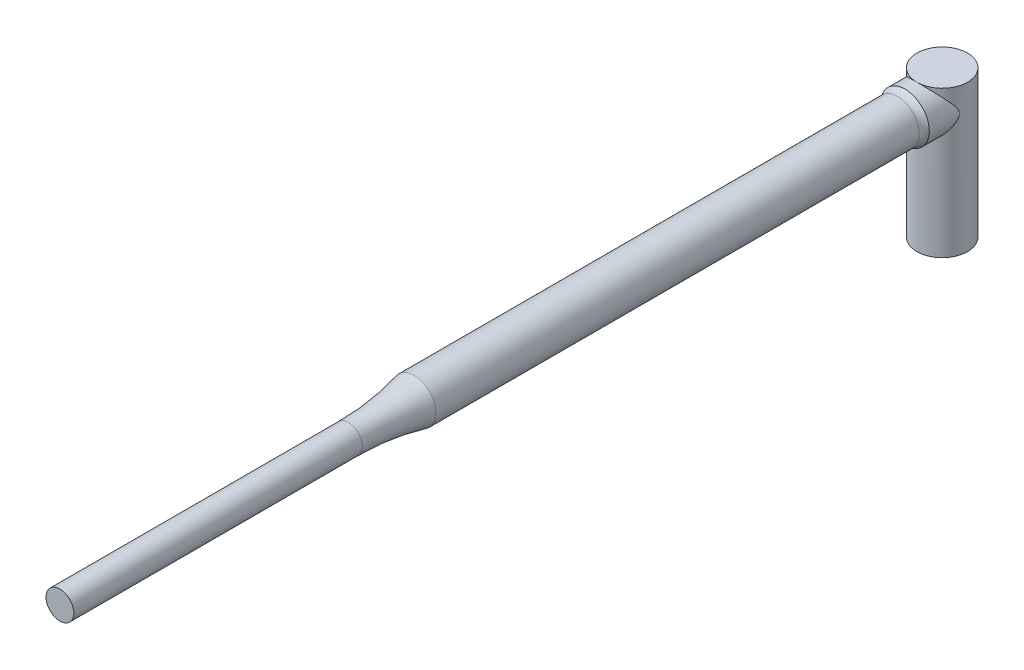
ISO-10303-21;
HEADER;
FILE_DESCRIPTION(('STEP AP214'),'2;1');
FILE_NAME('part.step','',(''),(''),'','','');
FILE_SCHEMA(('AUTOMOTIVE_DESIGN { 1 0 10303 214 1 1 1 1 }'));
ENDSEC;
DATA;
#1=APPLICATION_CONTEXT('core data for automotive mechanical design processes');
#2=APPLICATION_PROTOCOL_DEFINITION('international standard','automotive_design',2000,#1);
#3=PRODUCT_CONTEXT('',#1,'mechanical');
#4=PRODUCT('Part','Part','',(#3));
#5=PRODUCT_RELATED_PRODUCT_CATEGORY('part','',(#4));
#6=PRODUCT_DEFINITION_FORMATION('','',#4);
#7=PRODUCT_DEFINITION_CONTEXT('part definition',#1,'design');
#8=PRODUCT_DEFINITION('design','',#6,#7);
#9=PRODUCT_DEFINITION_SHAPE('','',#8);
#10=(LENGTH_UNIT() NAMED_UNIT(*) SI_UNIT(.MILLI.,.METRE.));
#11=(NAMED_UNIT(*) PLANE_ANGLE_UNIT() SI_UNIT($,.RADIAN.));
#12=(NAMED_UNIT(*) SI_UNIT($,.STERADIAN.) SOLID_ANGLE_UNIT());
#13=UNCERTAINTY_MEASURE_WITH_UNIT(LENGTH_MEASURE(1.E-05),#10,'distance_accuracy_value','');
#14=(GEOMETRIC_REPRESENTATION_CONTEXT(3) GLOBAL_UNCERTAINTY_ASSIGNED_CONTEXT((#13)) GLOBAL_UNIT_ASSIGNED_CONTEXT((#10,
#11,#12)) REPRESENTATION_CONTEXT('',''));
#15=CARTESIAN_POINT('',(0.,0.,0.));
#16=DIRECTION('',(0.,0.,1.));
#17=DIRECTION('',(1.,0.,0.));
#18=AXIS2_PLACEMENT_3D('',#15,#16,#17);
#19=CARTESIAN_POINT('',(0.,29.,0.));
#20=DIRECTION('',(0.,-1.,0.));
#21=DIRECTION('',(0.,0.,-1.));
#22=AXIS2_PLACEMENT_3D('',#19,#20,#21);
#23=CYLINDRICAL_SURFACE('',#22,5.);
#24=CARTESIAN_POINT('',(0.,0.,0.));
#25=DIRECTION('',(0.,1.,0.));
#26=DIRECTION('',(0.,0.,1.));
#27=AXIS2_PLACEMENT_3D('',#24,#25,#26);
#28=CIRCLE('',#27,5.);
#29=CARTESIAN_POINT('',(0.,0.,5.));
#30=VERTEX_POINT('',#29);
#31=EDGE_CURVE('E57',#30,#30,#28,.T.);
#32=ORIENTED_EDGE('',*,*,#31,.T.);
#33=EDGE_LOOP('',(#32));
#34=FACE_BOUND('',#33,.T.);
#35=CARTESIAN_POINT('',(0.,29.,0.));
#36=DIRECTION('',(0.,1.,0.));
#37=DIRECTION('',(0.,0.,1.));
#38=AXIS2_PLACEMENT_3D('',#35,#36,#37);
#39=CIRCLE('',#38,5.);
#40=CARTESIAN_POINT('',(0.,29.,5.));
#41=VERTEX_POINT('',#40);
#42=EDGE_CURVE('E52',#41,#41,#39,.T.);
#43=ORIENTED_EDGE('',*,*,#42,.F.);
#44=CARTESIAN_POINT('',(0.,29.,5.));
#45=CARTESIAN_POINT('',(-0.108666334102559,28.9999994876729,4.99999948894301));
#46=CARTESIAN_POINT('',(-0.217341014836858,28.9963027031347,4.99645026906441));
#47=CARTESIAN_POINT('',(-0.433779392075084,28.9815907093796,4.98232932673554));
#48=CARTESIAN_POINT('',(-0.541542617537456,28.9705719253294,4.97175417400158));
#49=CARTESIAN_POINT('',(-0.755368421051561,28.9414216519406,4.94379028020062));
#50=CARTESIAN_POINT('',(-0.861428193944477,28.9232794773518,4.92639130328448));
#51=CARTESIAN_POINT('',(-1.07092716138335,28.880230653768,4.88513267549212));
#52=CARTESIAN_POINT('',(-1.17436508698639,28.8553207951497,4.86126995915675));
#53=CARTESIAN_POINT('',(-1.37713940050348,28.7993982975048,4.80774371752179));
#54=CARTESIAN_POINT('',(-1.47650078238514,28.7684329596938,4.77812516341369));
#55=CARTESIAN_POINT('',(-1.6714539107134,28.7007666333182,4.71347013231617));
#56=CARTESIAN_POINT('',(-1.7670442353715,28.6640635068546,4.67843163590859));
#57=CARTESIAN_POINT('',(-2.04742973414759,28.5461584532109,4.56601914203934));
#58=CARTESIAN_POINT('',(-2.22603488476282,28.4571054817868,4.48129500256816));
#59=CARTESIAN_POINT('',(-2.63413344553697,28.22209656589,4.25855646492008));
#60=CARTESIAN_POINT('',(-2.85461963750567,28.0677546972577,4.11290956708302));
#61=CARTESIAN_POINT('',(-3.15758927850058,27.8175819801787,3.87892226792849));
#62=CARTESIAN_POINT('',(-3.25410546384993,27.7309030782729,3.79817625785519));
#63=CARTESIAN_POINT('',(-3.43805978110448,27.5520413742906,3.63249829685912));
#64=CARTESIAN_POINT('',(-3.52549848446378,27.4598589192552,3.54756660993398));
#65=CARTESIAN_POINT('',(-3.71912950135635,27.2391200290437,3.34568840161989));
#66=CARTESIAN_POINT('',(-3.82186969196473,27.1086737661815,3.22749960471579));
#67=CARTESIAN_POINT('',(-4.01217062153544,26.8400028696814,2.98762809792712));
#68=CARTESIAN_POINT('',(-4.0997209748483,26.701772999074,2.865943063326));
#69=CARTESIAN_POINT('',(-4.25993294561414,26.4179924993914,2.62187857925505));
#70=CARTESIAN_POINT('',(-4.33261742665085,26.2724535476714,2.4995004982114));
#71=CARTESIAN_POINT('',(-4.46351509384735,25.9730701537287,2.25739480813768));
#72=CARTESIAN_POINT('',(-4.52174353737661,25.8192346785317,2.13766452720062));
#73=CARTESIAN_POINT('',(-4.60716250829844,25.5516269909255,1.94457484411109));
#74=CARTESIAN_POINT('',(-4.63830721094698,25.4409290576665,1.86871083524089));
#75=CARTESIAN_POINT('',(-4.69349383270595,25.2123994217591,1.72538006713553));
#76=CARTESIAN_POINT('',(-4.71754210301083,25.0945742124323,1.65790583068008));
#77=CARTESIAN_POINT('',(-4.75132517833322,24.8872110971655,1.55782052198113));
#78=CARTESIAN_POINT('',(-4.76318681985278,24.80017193551,1.5208776230768));
#79=CARTESIAN_POINT('',(-4.78231414591119,24.6213032933281,1.45962757350143));
#80=CARTESIAN_POINT('',(-4.78959424608012,24.5294898321668,1.43528083299412));
#81=CARTESIAN_POINT('',(-4.79802441699647,24.3581775537683,1.40682571805981));
#82=CARTESIAN_POINT('',(-4.79999652004894,24.2791895025968,1.40001211684442));
#83=CARTESIAN_POINT('',(-4.80000346934737,24.121262193135,1.39998791962794));
#84=CARTESIAN_POINT('',(-4.7980407931867,24.0423229354284,1.4067687636784));
#85=CARTESIAN_POINT('',(-4.78932829003187,23.864891728207,1.43618059644902));
#86=CARTESIAN_POINT('',(-4.78138869455439,23.7671355925422,1.46272859601791));
#87=CARTESIAN_POINT('',(-4.76036043230233,23.5769172183916,1.52976591044666));
#88=CARTESIAN_POINT('',(-4.74724513847658,23.4844852344281,1.57032718183002));
#89=CARTESIAN_POINT('',(-4.71127096382163,23.2731042597668,1.67570655399337));
#90=CARTESIAN_POINT('',(-4.68660743768743,23.1562694614043,1.74403785776021));
#91=CARTESIAN_POINT('',(-4.6302315276597,22.9293166457595,1.88866250883097));
#92=CARTESIAN_POINT('',(-4.59850395114825,22.819213767308,1.96497282606616));
#93=CARTESIAN_POINT('',(-4.52819195095979,22.6036362455162,2.12200921039833));
#94=CARTESIAN_POINT('',(-4.48957489136809,22.4981867491046,2.20275496985636));
#95=CARTESIAN_POINT('',(-4.40571664792901,22.2915793992254,2.36602915853915));
#96=CARTESIAN_POINT('',(-4.36048113484795,22.1904179664512,2.44855601060833));
#97=CARTESIAN_POINT('',(-4.24145351730467,21.9470467280173,2.65130405002382));
#98=CARTESIAN_POINT('',(-4.16396833941558,21.8068388286845,2.77178442584361));
#99=CARTESIAN_POINT('',(-3.99451034792092,21.5335934537786,3.01088153042212));
#100=CARTESIAN_POINT('',(-3.90252854299023,21.4005604975536,3.12949705198216));
#101=CARTESIAN_POINT('',(-3.70395995163979,21.1427054944133,3.36213857773947));
#102=CARTESIAN_POINT('',(-3.59743011781207,21.0178541080341,3.47618033951546));
#103=CARTESIAN_POINT('',(-3.36907404148919,20.7770100257808,3.69792725597155));
#104=CARTESIAN_POINT('',(-3.24725829058651,20.6610113407852,3.80563668313373));
#105=CARTESIAN_POINT('',(-2.94897718188619,20.4062360164895,4.04351087483246));
#106=CARTESIAN_POINT('',(-2.7670579956831,20.2710087985499,4.17076979191824));
#107=CARTESIAN_POINT('',(-2.37658270610564,20.0232549286279,4.40494944861695));
#108=CARTESIAN_POINT('',(-2.16805556184616,19.9107039351284,4.51189198947898));
#109=CARTESIAN_POINT('',(-1.76375821447192,19.7312960343797,4.68280962418389));
#110=CARTESIAN_POINT('',(-1.57182598295789,19.6599263992792,4.75099628140664));
#111=CARTESIAN_POINT('',(-1.27378233111778,19.5709314083165,4.8361351842589));
#112=CARTESIAN_POINT('',(-1.17271762786842,19.5442720160726,4.86166211251646));
#113=CARTESIAN_POINT('',(-0.967782848202917,19.4974024003608,4.90656483655382));
#114=CARTESIAN_POINT('',(-0.863913997149906,19.4771894078669,4.92594327337584));
#115=CARTESIAN_POINT('',(-0.653429101719935,19.4434820090136,4.95826991671403));
#116=CARTESIAN_POINT('',(-0.546800061336134,19.4300298258025,4.97117771100739));
#117=CARTESIAN_POINT('',(-0.332314404224202,19.4103071173318,4.990105226489));
#118=CARTESIAN_POINT('',(-0.22445834063993,19.4040334761832,4.99612793618822));
#119=CARTESIAN_POINT('',(-0.0084003731196144,19.3987910632874,5.00116053720201));
#120=CARTESIAN_POINT('',(0.0998015448480584,19.3998225917761,5.00017014028411));
#121=CARTESIAN_POINT('',(0.315591885545609,19.4091686866147,4.99119854963938));
#122=CARTESIAN_POINT('',(0.423180344627721,19.4174828168027,4.98321777457283));
#123=CARTESIAN_POINT('',(0.626942834344137,19.4401201971992,4.96149640600201));
#124=CARTESIAN_POINT('',(0.723251799100216,19.4538161579032,4.94835717664023));
#125=CARTESIAN_POINT('',(0.914013900537336,19.4868307438237,4.91670040241339));
#126=CARTESIAN_POINT('',(1.00846644678606,19.5061511279523,4.89818117507854));
#127=CARTESIAN_POINT('',(1.28813905576866,19.5721171418834,4.83499095794425));
#128=CARTESIAN_POINT('',(1.46983238795466,19.6267858635484,4.78266989340158));
#129=CARTESIAN_POINT('',(1.83182022373701,19.7588226804396,4.6565700857528));
#130=CARTESIAN_POINT('',(2.01122404859207,19.8374549940898,4.58159910233441));
#131=CARTESIAN_POINT('',(2.35331536006991,20.0120598843397,4.41566691660592));
#132=CARTESIAN_POINT('',(2.51599336802006,20.1080422092991,4.32469672568633));
#133=CARTESIAN_POINT('',(2.91095176659933,20.372411282231,4.0752313731647));
#134=CARTESIAN_POINT('',(3.13068815262168,20.5510859829399,3.90760557227929));
#135=CARTESIAN_POINT('',(3.42865364169691,20.8379372489336,3.64173001602924));
#136=CARTESIAN_POINT('',(3.52284285450964,20.9368889904705,3.55052179615393));
#137=CARTESIAN_POINT('',(3.70098103308251,21.1404242032609,3.36441626976323));
#138=CARTESIAN_POINT('',(3.78493183401957,21.2450066603822,3.2695196284095));
#139=CARTESIAN_POINT('',(3.94499610791673,21.4621708442076,3.0746293269688));
#140=CARTESIAN_POINT('',(4.02083401324587,21.5748928292403,2.97456723783894));
#141=CARTESIAN_POINT('',(4.16231088834259,21.8055315386175,2.77314008892007));
#142=CARTESIAN_POINT('',(4.22794652606265,21.9234499440349,2.67177461510131));
#143=CARTESIAN_POINT('',(4.34909325483156,22.1644289275852,2.46966376938382));
#144=CARTESIAN_POINT('',(4.40462381011773,22.2874790465854,2.36891757439106));
#145=CARTESIAN_POINT('',(4.50578000032636,22.5397483754437,2.17032289310182));
#146=CARTESIAN_POINT('',(4.55141293936344,22.6689629496356,2.07247231630343));
#147=CARTESIAN_POINT('',(4.62422875567699,22.9081970547314,1.90345991523194));
#148=CARTESIAN_POINT('',(4.65327589309938,23.0166900442281,1.83095154284662));
#149=CARTESIAN_POINT('',(4.70459026965516,23.2408018782574,1.69471732090598));
#150=CARTESIAN_POINT('',(4.726860682422,23.3564173566319,1.63098736797334));
#151=CARTESIAN_POINT('',(4.7578347671325,23.5596683881742,1.5377421917954));
#152=CARTESIAN_POINT('',(4.76860393913655,23.6448665401443,1.50374491514718));
#153=CARTESIAN_POINT('',(4.78570236319302,23.8195954585291,1.4484120969904));
#154=CARTESIAN_POINT('',(4.79204775888344,23.9091091833393,1.42703056138312));
#155=CARTESIAN_POINT('',(4.79967488201611,24.0923222105446,1.40119468262126));
#156=CARTESIAN_POINT('',(4.8008800517101,24.1860639182064,1.39699629956979));
#157=CARTESIAN_POINT('',(4.79781194569929,24.3724038103082,1.40748438240507));
#158=CARTESIAN_POINT('',(4.79353211380326,24.4650004924443,1.42219344832108));
#159=CARTESIAN_POINT('',(4.77853356110423,24.6671445820746,1.47186376328373));
#160=CARTESIAN_POINT('',(4.76653817679854,24.7755624883631,1.51077160061603));
#161=CARTESIAN_POINT('',(4.73646881791954,24.9856350762957,1.60256393500836));
#162=CARTESIAN_POINT('',(4.71836267210146,25.0872504793198,1.65552208016887));
#163=CARTESIAN_POINT('',(4.66772647172112,25.3285248288004,1.79440769205962));
#164=CARTESIAN_POINT('',(4.63235979994339,25.4650996019461,1.88454878143796));
#165=CARTESIAN_POINT('',(4.55163886514237,25.7302837974286,2.07198619145325));
#166=CARTESIAN_POINT('',(4.50626518557496,25.858877103096,2.16929617398629));
#167=CARTESIAN_POINT('',(4.40561991268216,26.1101989678231,2.36703539430921));
#168=CARTESIAN_POINT('',(4.35032375871268,26.2329119943741,2.46747184911238));
#169=CARTESIAN_POINT('',(4.22988541120685,26.4728992706565,2.66867559719356));
#170=CARTESIAN_POINT('',(4.16475145978155,26.5901779667883,2.76944254509157));
#171=CARTESIAN_POINT('',(4.02038584361396,26.8261537480001,2.9754312071811));
#172=CARTESIAN_POINT('',(3.94056485204325,26.9445553044236,3.08058218947232));
#173=CARTESIAN_POINT('',(3.76930819194288,27.1753972884179,3.28792294790424));
#174=CARTESIAN_POINT('',(3.67786852568576,27.2878356452203,3.39011168987002));
#175=CARTESIAN_POINT('',(3.38604117830396,27.6146468419257,3.68945679454583));
#176=CARTESIAN_POINT('',(3.167555372458,27.8194991338089,3.88026698806117));
#177=CARTESIAN_POINT('',(2.75265053286014,28.1382363904952,4.17944265430169));
#178=CARTESIAN_POINT('',(2.56868761904365,28.2611428230034,4.29553754903475));
#179=CARTESIAN_POINT('',(2.17636283060399,28.4841849939231,4.50699029250245));
#180=CARTESIAN_POINT('',(1.96801782999303,28.5843363408073,4.60236235374707));
#181=CARTESIAN_POINT('',(1.56401495101358,28.7423729896221,4.753177202249));
#182=CARTESIAN_POINT('',(1.37148963414753,28.8044231555207,4.81253596069462));
#183=CARTESIAN_POINT('',(1.07429595309876,28.8793538929581,4.88429142336469));
#184=CARTESIAN_POINT('',(0.973894630041848,28.9012988067522,4.90532184904763));
#185=CARTESIAN_POINT('',(0.770851790828313,28.9388208929427,4.94129482598124));
#186=CARTESIAN_POINT('',(0.668211264066722,28.9544008200043,4.95624001081814));
#187=CARTESIAN_POINT('',(0.471520537215146,28.9777087809011,4.97860338465539));
#188=CARTESIAN_POINT('',(0.377609970664208,28.9860548834952,4.98661397320672));
#189=CARTESIAN_POINT('',(0.189135139223462,28.9972013470696,4.99731310889488));
#190=CARTESIAN_POINT('',(0.0945707304677343,29.0000004458709,5.00000044476547));
#191=CARTESIAN_POINT('',(0.,29.,5.));
#192=B_SPLINE_CURVE_WITH_KNOTS('',3,(#44,#45,#46,#47,#48,#49,#50,#51,#52,#53,#54,#55,#56,#57,
#58,#59,#60,#61,#62,#63,#64,#65,#66,#67,#68,#69,#70,#71,#72,#73,#74,#75,#76,#77,#78,#79,#80,#81,
#82,#83,#84,#85,#86,#87,#88,#89,#90,#91,#92,#93,#94,#95,#96,#97,#98,#99,#100,#101,#102,#103,
#104,#105,#106,#107,#108,#109,#110,#111,#112,#113,#114,#115,#116,#117,#118,#119,#120,#121,#122,
#123,#124,#125,#126,#127,#128,#129,#130,#131,#132,#133,#134,#135,#136,#137,#138,#139,#140,#141,
#142,#143,#144,#145,#146,#147,#148,#149,#150,#151,#152,#153,#154,#155,#156,#157,#158,#159,#160,
#161,#162,#163,#164,#165,#166,#167,#168,#169,#170,#171,#172,#173,#174,#175,#176,#177,#178,#179,
#180,#181,#182,#183,#184,#185,#186,#187,#188,#189,#190,#191),.UNSPECIFIED.,.T.,.F.,(4,2,2,2,2,2,
2,2,2,2,2,2,2,2,2,2,2,2,2,2,2,2,2,2,2,2,2,2,2,2,2,2,2,2,2,2,2,2,2,2,2,2,2,2,2,2,2,2,2,2,2,2,2,2,
2,2,2,2,2,2,2,2,2,2,2,2,2,2,2,2,2,2,2,4),(0.,0.325894020193308,0.651947269244219,
0.978491485733102,1.30519083933801,1.6294334317352,1.95379712608655,2.60190170283711,
3.51469444214531,3.97279147249175,4.43085964677716,5.04147710784324,5.65251043112771,
6.26259680396342,6.87203650803354,7.28498517288115,7.69756312644085,7.98275228355502,
8.2670395583952,8.50374685243367,8.74030514694921,9.04330768451372,9.34788981640676,
9.75964918979179,10.1723028363878,10.5869658257193,11.0012755853953,11.601929262605,
12.2029569635059,12.8016958328459,13.4000259787182,14.1771236021091,14.9533825622649,
15.5979419438728,15.9203792442758,16.2426778558597,16.5669650492028,16.8911114302972,
17.2152711335979,17.5394114239975,17.8335555046579,18.1277916712731,18.7157886525394,
19.3427529649565,19.9700706477155,20.9514846039411,21.4439640121188,21.9363550160277,
22.4421502535368,22.9481103375918,23.4530852888009,23.9576863075623,24.3583785031447,
24.7588827592302,25.035225833948,25.3105550983432,25.5899710612137,25.8697213201007,
26.215205201867,26.5625370812709,27.0637071930038,27.5658584140515,28.0692701769092,
28.5722624969307,29.1037284294306,29.6353777252441,30.6943924713404,31.4414731912109,
32.1880399059258,32.8175523040501,33.1319228868579,33.4461572705715,33.7297135838619,
34.0133344108575),.UNSPECIFIED.);
#193=EDGE_CURVE('E54',#41,#41,#192,.T.);
#194=ORIENTED_EDGE('',*,*,#193,.F.);
#195=EDGE_LOOP('',(#43,#194));
#196=FACE_BOUND('',#195,.T.);
#197=ADVANCED_FACE('F39',(#34,#196),#23,.T.);
#198=CARTESIAN_POINT('',(0.,29.,0.));
#199=DIRECTION('',(0.,1.,0.));
#200=DIRECTION('',(0.,0.,1.));
#201=AXIS2_PLACEMENT_3D('',#198,#199,#200);
#202=PLANE('',#201);
#203=ORIENTED_EDGE('',*,*,#42,.T.);
#204=EDGE_LOOP('',(#203));
#205=FACE_BOUND('',#204,.T.);
#206=ADVANCED_FACE('F85',(#205),#202,.T.);
#207=CARTESIAN_POINT('',(0.,0.,0.));
#208=DIRECTION('',(0.,1.,0.));
#209=DIRECTION('',(0.,0.,1.));
#210=AXIS2_PLACEMENT_3D('',#207,#208,#209);
#211=PLANE('',#210);
#212=ORIENTED_EDGE('',*,*,#31,.F.);
#213=EDGE_LOOP('',(#212));
#214=FACE_BOUND('',#213,.T.);
#215=ADVANCED_FACE('F82',(#214),#211,.F.);
#216=CARTESIAN_POINT('',(0.,24.2,7.35));
#217=DIRECTION('',(0.,0.,-1.));
#218=DIRECTION('',(-1.,0.,0.));
#219=AXIS2_PLACEMENT_3D('',#216,#217,#218);
#220=CYLINDRICAL_SURFACE('',#219,4.8);
#221=CARTESIAN_POINT('',(0.,24.2,7.35));
#222=DIRECTION('',(0.,0.,1.));
#223=DIRECTION('',(1.,0.,0.));
#224=AXIS2_PLACEMENT_3D('',#221,#222,#223);
#225=CIRCLE('',#224,4.8);
#226=CARTESIAN_POINT('',(4.8,24.2,7.35));
#227=VERTEX_POINT('',#226);
#228=EDGE_CURVE('E72',#227,#227,#225,.T.);
#229=ORIENTED_EDGE('',*,*,#228,.F.);
#230=EDGE_LOOP('',(#229));
#231=FACE_BOUND('',#230,.T.);
#232=ORIENTED_EDGE('',*,*,#193,.T.);
#233=EDGE_LOOP('',(#232));
#234=FACE_BOUND('',#233,.T.);
#235=ADVANCED_FACE('F76',(#231,#234),#220,.T.);
#236=CARTESIAN_POINT('',(0.,24.2,104.35));
#237=DIRECTION('',(0.,0.,-1.));
#238=DIRECTION('',(-1.,0.,0.));
#239=AXIS2_PLACEMENT_3D('',#236,#237,#238);
#240=CYLINDRICAL_SURFACE('',#239,4.305);
#241=CARTESIAN_POINT('',(0.,24.2,8.84331008166422));
#242=DIRECTION('',(0.,0.,-1.));
#243=DIRECTION('',(-1.,0.,0.));
#244=AXIS2_PLACEMENT_3D('',#241,#242,#243);
#245=CIRCLE('',#244,4.305);
#246=CARTESIAN_POINT('',(-4.305,24.2,8.84331008166424));
#247=VERTEX_POINT('',#246);
#248=EDGE_CURVE('E11',#247,#247,#245,.F.);
#249=CARTESIAN_POINT('',(0.,24.2,104.35));
#250=DIRECTION('',(0.,0.,1.));
#251=DIRECTION('',(1.,0.,0.));
#252=AXIS2_PLACEMENT_3D('',#249,#250,#251);
#253=CIRCLE('',#252,4.305);
#254=CARTESIAN_POINT('',(-4.305,24.2,104.35));
#255=VERTEX_POINT('',#254);
#256=EDGE_CURVE('E162',#255,#255,#253,.T.);
#257=CARTESIAN_POINT('',(-4.305,24.2,8.84331008166424));
#258=CARTESIAN_POINT('',(-4.305,24.2,9.83817143498023));
#259=CARTESIAN_POINT('',(-4.305,24.2,10.8330327882962));
#260=CARTESIAN_POINT('',(-4.305,24.2,12.8227554949282));
#261=CARTESIAN_POINT('',(-4.305,24.2,13.8176168482442));
#262=CARTESIAN_POINT('',(-4.305,24.2,15.8073395548762));
#263=CARTESIAN_POINT('',(-4.305,24.2,16.8022009081922));
#264=CARTESIAN_POINT('',(-4.305,24.2,18.7919236148242));
#265=CARTESIAN_POINT('',(-4.305,24.2,19.7867849681402));
#266=CARTESIAN_POINT('',(-4.305,24.2,21.7765076747722));
#267=CARTESIAN_POINT('',(-4.305,24.2,22.7713690280882));
#268=CARTESIAN_POINT('',(-4.305,24.2,24.7610917347202));
#269=CARTESIAN_POINT('',(-4.305,24.2,25.7559530880362));
#270=CARTESIAN_POINT('',(-4.305,24.2,27.7456757946682));
#271=CARTESIAN_POINT('',(-4.305,24.2,28.7405371479842));
#272=CARTESIAN_POINT('',(-4.305,24.2,30.7302598546162));
#273=CARTESIAN_POINT('',(-4.305,24.2,31.7251212079322));
#274=CARTESIAN_POINT('',(-4.305,24.2,33.7148439145642));
#275=CARTESIAN_POINT('',(-4.305,24.2,34.7097052678802));
#276=CARTESIAN_POINT('',(-4.305,24.2,36.6994279745122));
#277=CARTESIAN_POINT('',(-4.305,24.2,37.6942893278282));
#278=CARTESIAN_POINT('',(-4.305,24.2,39.6840120344602));
#279=CARTESIAN_POINT('',(-4.305,24.2,40.6788733877762));
#280=CARTESIAN_POINT('',(-4.305,24.2,42.6685960944082));
#281=CARTESIAN_POINT('',(-4.305,24.2,43.6634574477242));
#282=CARTESIAN_POINT('',(-4.305,24.2,45.6531801543561));
#283=CARTESIAN_POINT('',(-4.305,24.2,46.6480415076721));
#284=CARTESIAN_POINT('',(-4.305,24.2,48.6377642143041));
#285=CARTESIAN_POINT('',(-4.305,24.2,49.6326255676201));
#286=CARTESIAN_POINT('',(-4.305,24.2,51.6223482742521));
#287=CARTESIAN_POINT('',(-4.305,24.2,52.6172096275681));
#288=CARTESIAN_POINT('',(-4.305,24.2,54.6069323342001));
#289=CARTESIAN_POINT('',(-4.305,24.2,55.6017936875161));
#290=CARTESIAN_POINT('',(-4.305,24.2,57.5915163941481));
#291=CARTESIAN_POINT('',(-4.305,24.2,58.5863777474641));
#292=CARTESIAN_POINT('',(-4.305,24.2,60.5761004540961));
#293=CARTESIAN_POINT('',(-4.305,24.2,61.5709618074121));
#294=CARTESIAN_POINT('',(-4.305,24.2,63.5606845140441));
#295=CARTESIAN_POINT('',(-4.305,24.2,64.5555458673601));
#296=CARTESIAN_POINT('',(-4.305,24.2,66.5452685739921));
#297=CARTESIAN_POINT('',(-4.305,24.2,67.5401299273081));
#298=CARTESIAN_POINT('',(-4.305,24.2,69.5298526339401));
#299=CARTESIAN_POINT('',(-4.305,24.2,70.5247139872561));
#300=CARTESIAN_POINT('',(-4.305,24.2,72.5144366938881));
#301=CARTESIAN_POINT('',(-4.305,24.2,73.5092980472041));
#302=CARTESIAN_POINT('',(-4.305,24.2,75.4990207538361));
#303=CARTESIAN_POINT('',(-4.305,24.2,76.4938821071521));
#304=CARTESIAN_POINT('',(-4.305,24.2,78.4836048137841));
#305=CARTESIAN_POINT('',(-4.305,24.2,79.4784661671001));
#306=CARTESIAN_POINT('',(-4.305,24.2,81.4681888737321));
#307=CARTESIAN_POINT('',(-4.305,24.2,82.463050227048));
#308=CARTESIAN_POINT('',(-4.305,24.2,84.4527729336801));
#309=CARTESIAN_POINT('',(-4.305,24.2,85.447634286996));
#310=CARTESIAN_POINT('',(-4.305,24.2,87.437356993628));
#311=CARTESIAN_POINT('',(-4.305,24.2,88.432218346944));
#312=CARTESIAN_POINT('',(-4.305,24.2,90.421941053576));
#313=CARTESIAN_POINT('',(-4.305,24.2,91.416802406892));
#314=CARTESIAN_POINT('',(-4.305,24.2,93.406525113524));
#315=CARTESIAN_POINT('',(-4.305,24.2,94.40138646684));
#316=CARTESIAN_POINT('',(-4.305,24.2,96.391109173472));
#317=CARTESIAN_POINT('',(-4.305,24.2,97.385970526788));
#318=CARTESIAN_POINT('',(-4.305,24.2,99.37569323342));
#319=CARTESIAN_POINT('',(-4.305,24.2,100.370554586736));
#320=CARTESIAN_POINT('',(-4.305,24.2,102.360277293368));
#321=CARTESIAN_POINT('',(-4.305,24.2,103.355138646684));
#322=CARTESIAN_POINT('',(-4.305,24.2,104.35));
#323=B_SPLINE_CURVE_WITH_KNOTS('',3,(#257,#258,#259,#260,#261,#262,#263,#264,#265,#266,#267,
#268,#269,#270,#271,#272,#273,#274,#275,#276,#277,#278,#279,#280,#281,#282,#283,#284,#285,#286,
#287,#288,#289,#290,#291,#292,#293,#294,#295,#296,#297,#298,#299,#300,#301,#302,#303,#304,#305,
#306,#307,#308,#309,#310,#311,#312,#313,#314,#315,#316,#317,#318,#319,#320,#321,#322),
.UNSPECIFIED.,.F.,.F.,(4,2,2,2,2,2,2,2,2,2,2,2,2,2,2,2,2,2,2,2,2,2,2,2,2,2,2,2,2,2,2,2,4),(0.,
2.98458405994799,5.96916811989598,8.95375217984398,11.938336239792,14.92292029974,
17.907504359688,20.892088419636,23.8766724795839,26.8612565395319,29.8458405994799,
32.8304246594279,35.8150087193759,38.7995927793239,41.7841768392719,44.7687608992199,
47.7533449591679,50.7379290191159,53.7225130790639,56.7070971390119,59.6916811989599,
62.6762652589078,65.6608493188558,68.6454333788038,71.6300174387518,74.6146014986998,
77.5991855586478,80.5837696185958,83.5683536785438,86.5529377384918,89.5375217984398,
92.5221058583878,95.5066899183358),.UNSPECIFIED.);
#324=EDGE_CURVE('BSEAM81',#247,#255,#323,.T.);
#325=ORIENTED_EDGE('',*,*,#248,.T.);
#326=ORIENTED_EDGE('',*,*,#256,.F.);
#327=ORIENTED_EDGE('',*,*,#324,.T.);
#328=ORIENTED_EDGE('',*,*,#324,.F.);
#329=EDGE_LOOP('',(#325,#327,#326,#328));
#330=FACE_BOUND('',#329,.T.);
#331=ADVANCED_FACE('F81',(#330),#240,.T.);
#332=CARTESIAN_POINT('',(0.,24.2,174.35));
#333=DIRECTION('',(0.,0.,-1.));
#334=DIRECTION('',(-1.,0.,0.));
#335=AXIS2_PLACEMENT_3D('',#332,#333,#334);
#336=CYLINDRICAL_SURFACE('',#335,2.75);
#337=CARTESIAN_POINT('',(0.,24.2,117.335837477806));
#338=DIRECTION('',(0.,0.,-1.));
#339=DIRECTION('',(-1.,0.,0.));
#340=AXIS2_PLACEMENT_3D('',#337,#338,#339);
#341=CIRCLE('',#340,2.75);
#342=CARTESIAN_POINT('',(-2.75,24.2,117.335837477806));
#343=VERTEX_POINT('',#342);
#344=EDGE_CURVE('E47',#343,#343,#341,.F.);
#345=ORIENTED_EDGE('',*,*,#344,.T.);
#346=EDGE_LOOP('',(#345));
#347=FACE_BOUND('',#346,.T.);
#348=CARTESIAN_POINT('',(0.,24.2,174.35));
#349=DIRECTION('',(0.,0.,1.));
#350=DIRECTION('',(1.,0.,0.));
#351=AXIS2_PLACEMENT_3D('',#348,#349,#350);
#352=CIRCLE('',#351,2.75);
#353=CARTESIAN_POINT('',(2.75,24.2,174.35));
#354=VERTEX_POINT('',#353);
#355=EDGE_CURVE('E164',#354,#354,#352,.T.);
#356=ORIENTED_EDGE('',*,*,#355,.F.);
#357=EDGE_LOOP('',(#356));
#358=FACE_BOUND('',#357,.T.);
#359=ADVANCED_FACE('F120',(#347,#358),#336,.T.);
#360=CARTESIAN_POINT('',(0.,24.2,174.35));
#361=DIRECTION('',(0.,0.,1.));
#362=DIRECTION('',(1.,0.,0.));
#363=AXIS2_PLACEMENT_3D('',#360,#361,#362);
#364=PLANE('',#363);
#365=ORIENTED_EDGE('',*,*,#355,.T.);
#366=EDGE_LOOP('',(#365));
#367=FACE_BOUND('',#366,.T.);
#368=ADVANCED_FACE('F114',(#367),#364,.T.);
#369=CARTESIAN_POINT('',(0.,24.2,117.335837477806));
#370=DIRECTION('',(0.,0.,-1.));
#371=DIRECTION('',(-1.,0.,0.));
#372=AXIS2_PLACEMENT_3D('',#369,#370,#371);
#373=TOROIDAL_SURFACE('',#372,57.75,55.);
#374=ORIENTED_EDGE('',*,*,#256,.T.);
#375=EDGE_LOOP('',(#374));
#376=FACE_BOUND('',#375,.T.);
#377=ORIENTED_EDGE('',*,*,#344,.F.);
#378=EDGE_LOOP('',(#377));
#379=FACE_BOUND('',#378,.T.);
#380=ADVANCED_FACE('F119',(#376,#379),#373,.F.);
#381=CARTESIAN_POINT('',(0.,24.2,8.84331008166422));
#382=DIRECTION('',(0.,0.,-1.));
#383=DIRECTION('',(-1.,0.,0.));
#384=AXIS2_PLACEMENT_3D('',#381,#382,#383);
#385=TOROIDAL_SURFACE('',#384,6.805,2.5);
#386=ORIENTED_EDGE('',*,*,#228,.T.);
#387=EDGE_LOOP('',(#386));
#388=FACE_BOUND('',#387,.T.);
#389=ORIENTED_EDGE('',*,*,#248,.F.);
#390=EDGE_LOOP('',(#389));
#391=FACE_BOUND('',#390,.T.);
#392=ADVANCED_FACE('F41',(#388,#391),#385,.F.);
#393=CLOSED_SHELL('',(#197,#206,#215,#235,#331,#359,#368,#380,#392));
#394=MANIFOLD_SOLID_BREP('B2',#393);
#395=ADVANCED_BREP_SHAPE_REPRESENTATION('',(#18,#394),#14);
#396=SHAPE_DEFINITION_REPRESENTATION(#9,#395);
ENDSEC;
END-ISO-10303-21;
